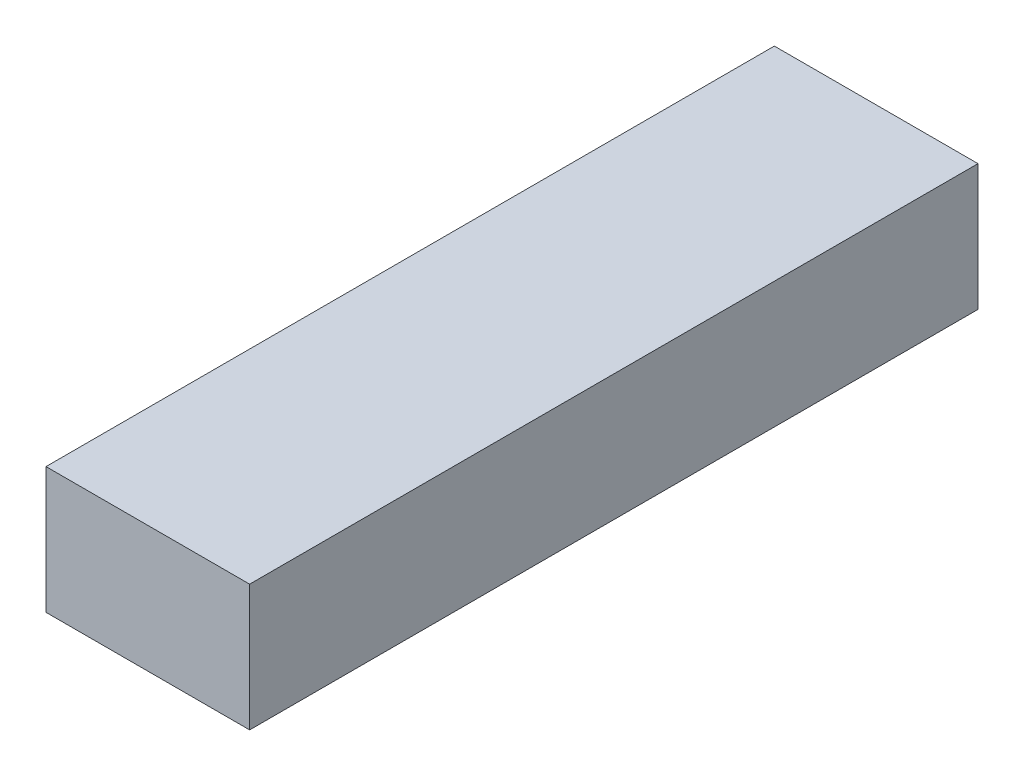
ISO-10303-21;
HEADER;
FILE_DESCRIPTION(('STEP AP214'),'2;1');
FILE_NAME('part.step','',(''),(''),'','','');
FILE_SCHEMA(('AUTOMOTIVE_DESIGN { 1 0 10303 214 1 1 1 1 }'));
ENDSEC;
DATA;
#1=APPLICATION_CONTEXT('core data for automotive mechanical design processes');
#2=APPLICATION_PROTOCOL_DEFINITION('international standard','automotive_design',2000,#1);
#3=PRODUCT_CONTEXT('',#1,'mechanical');
#4=PRODUCT('Part','Part','',(#3));
#5=PRODUCT_RELATED_PRODUCT_CATEGORY('part','',(#4));
#6=PRODUCT_DEFINITION_FORMATION('','',#4);
#7=PRODUCT_DEFINITION_CONTEXT('part definition',#1,'design');
#8=PRODUCT_DEFINITION('design','',#6,#7);
#9=PRODUCT_DEFINITION_SHAPE('','',#8);
#10=(LENGTH_UNIT() NAMED_UNIT(*) SI_UNIT(.MILLI.,.METRE.));
#11=(NAMED_UNIT(*) PLANE_ANGLE_UNIT() SI_UNIT($,.RADIAN.));
#12=(NAMED_UNIT(*) SI_UNIT($,.STERADIAN.) SOLID_ANGLE_UNIT());
#13=UNCERTAINTY_MEASURE_WITH_UNIT(LENGTH_MEASURE(1.E-05),#10,'distance_accuracy_value','');
#14=(GEOMETRIC_REPRESENTATION_CONTEXT(3) GLOBAL_UNCERTAINTY_ASSIGNED_CONTEXT((#13)) GLOBAL_UNIT_ASSIGNED_CONTEXT((#10,
#11,#12)) REPRESENTATION_CONTEXT('',''));
#15=CARTESIAN_POINT('',(0.,0.,0.));
#16=DIRECTION('',(0.,0.,1.));
#17=DIRECTION('',(1.,0.,0.));
#18=AXIS2_PLACEMENT_3D('',#15,#16,#17);
#19=CARTESIAN_POINT('',(-105.11421572935,33.8480011912268,-75.800025));
#20=DIRECTION('',(1.,0.,0.));
#21=DIRECTION('',(0.,0.,-1.));
#22=AXIS2_PLACEMENT_3D('',#19,#20,#21);
#23=PLANE('',#22);
#24=DIRECTION('',(0.,1.,0.));
#25=VECTOR('',#24,1.);
#26=CARTESIAN_POINT('',(-105.11421572935,33.8480011912268,44.199975));
#27=LINE('',#26,#25);
#28=CARTESIAN_POINT('',(-105.11421572935,33.8480011912268,44.199975));
#29=VERTEX_POINT('',#28);
#30=CARTESIAN_POINT('',(-105.11421572935,54.6480011912268,44.199975));
#31=VERTEX_POINT('',#30);
#32=EDGE_CURVE('E95',#29,#31,#27,.T.);
#33=ORIENTED_EDGE('',*,*,#32,.T.);
#34=DIRECTION('',(0.,0.,1.));
#35=VECTOR('',#34,1.);
#36=CARTESIAN_POINT('',(-105.11421572935,54.6480011912268,-75.800025));
#37=LINE('',#36,#35);
#38=CARTESIAN_POINT('',(-105.11421572935,54.6480011912268,-75.800025));
#39=VERTEX_POINT('',#38);
#40=EDGE_CURVE('E11',#39,#31,#37,.T.);
#41=ORIENTED_EDGE('',*,*,#40,.F.);
#42=DIRECTION('',(0.,1.,0.));
#43=VECTOR('',#42,1.);
#44=CARTESIAN_POINT('',(-105.11421572935,33.8480011912268,-75.800025));
#45=LINE('',#44,#43);
#46=CARTESIAN_POINT('',(-105.11421572935,33.8480011912268,-75.800025));
#47=VERTEX_POINT('',#46);
#48=EDGE_CURVE('E83',#47,#39,#45,.T.);
#49=ORIENTED_EDGE('',*,*,#48,.F.);
#50=DIRECTION('',(0.,0.,1.));
#51=VECTOR('',#50,1.);
#52=CARTESIAN_POINT('',(-105.11421572935,33.8480011912268,-75.800025));
#53=LINE('',#52,#51);
#54=EDGE_CURVE('E91',#47,#29,#53,.T.);
#55=ORIENTED_EDGE('',*,*,#54,.T.);
#56=EDGE_LOOP('',(#33,#41,#49,#55));
#57=FACE_BOUND('',#56,.T.);
#58=ADVANCED_FACE('F32',(#57),#23,.F.);
#59=CARTESIAN_POINT('',(-105.11421572935,54.6480011912268,-75.800025));
#60=DIRECTION('',(0.,-1.,0.));
#61=DIRECTION('',(0.,0.,-1.));
#62=AXIS2_PLACEMENT_3D('',#59,#60,#61);
#63=PLANE('',#62);
#64=DIRECTION('',(1.,0.,0.));
#65=VECTOR('',#64,1.);
#66=CARTESIAN_POINT('',(-105.11421572935,54.6480011912268,44.199975));
#67=LINE('',#66,#65);
#68=CARTESIAN_POINT('',(-71.5642157293498,54.6480011912268,44.199975));
#69=VERTEX_POINT('',#68);
#70=EDGE_CURVE('E87',#31,#69,#67,.T.);
#71=ORIENTED_EDGE('',*,*,#70,.T.);
#72=DIRECTION('',(0.,0.,1.));
#73=VECTOR('',#72,1.);
#74=CARTESIAN_POINT('',(-71.5642157293498,54.6480011912268,-75.800025));
#75=LINE('',#74,#73);
#76=CARTESIAN_POINT('',(-71.5642157293498,54.6480011912268,-75.800025));
#77=VERTEX_POINT('',#76);
#78=EDGE_CURVE('E40',#77,#69,#75,.T.);
#79=ORIENTED_EDGE('',*,*,#78,.F.);
#80=DIRECTION('',(1.,0.,0.));
#81=VECTOR('',#80,1.);
#82=CARTESIAN_POINT('',(-105.11421572935,54.6480011912268,-75.800025));
#83=LINE('',#82,#81);
#84=EDGE_CURVE('E78',#39,#77,#83,.T.);
#85=ORIENTED_EDGE('',*,*,#84,.F.);
#86=ORIENTED_EDGE('',*,*,#40,.T.);
#87=EDGE_LOOP('',(#71,#79,#85,#86));
#88=FACE_BOUND('',#87,.T.);
#89=ADVANCED_FACE('F86',(#88),#63,.F.);
#90=CARTESIAN_POINT('',(-71.5642157293498,33.8480011912268,-75.800025));
#91=DIRECTION('',(-1.,0.,0.));
#92=DIRECTION('',(0.,0.,1.));
#93=AXIS2_PLACEMENT_3D('',#90,#91,#92);
#94=PLANE('',#93);
#95=DIRECTION('',(0.,-1.,0.));
#96=VECTOR('',#95,1.);
#97=CARTESIAN_POINT('',(-71.5642157293498,33.8480011912268,44.199975));
#98=LINE('',#97,#96);
#99=CARTESIAN_POINT('',(-71.5642157293498,33.8480011912268,44.199975));
#100=VERTEX_POINT('',#99);
#101=EDGE_CURVE('E65',#69,#100,#98,.T.);
#102=ORIENTED_EDGE('',*,*,#101,.T.);
#103=DIRECTION('',(0.,0.,1.));
#104=VECTOR('',#103,1.);
#105=CARTESIAN_POINT('',(-71.5642157293498,33.8480011912268,-75.800025));
#106=LINE('',#105,#104);
#107=CARTESIAN_POINT('',(-71.5642157293498,33.8480011912268,-75.800025));
#108=VERTEX_POINT('',#107);
#109=EDGE_CURVE('E88',#108,#100,#106,.T.);
#110=ORIENTED_EDGE('',*,*,#109,.F.);
#111=DIRECTION('',(0.,-1.,0.));
#112=VECTOR('',#111,1.);
#113=CARTESIAN_POINT('',(-71.5642157293498,33.8480011912268,-75.800025));
#114=LINE('',#113,#112);
#115=EDGE_CURVE('E81',#77,#108,#114,.T.);
#116=ORIENTED_EDGE('',*,*,#115,.F.);
#117=ORIENTED_EDGE('',*,*,#78,.T.);
#118=EDGE_LOOP('',(#102,#110,#116,#117));
#119=FACE_BOUND('',#118,.T.);
#120=ADVANCED_FACE('F89',(#119),#94,.F.);
#121=CARTESIAN_POINT('',(-105.11421572935,33.8480011912268,-75.800025));
#122=DIRECTION('',(0.,1.,0.));
#123=DIRECTION('',(-1.,0.,0.));
#124=AXIS2_PLACEMENT_3D('',#121,#122,#123);
#125=PLANE('',#124);
#126=DIRECTION('',(-1.,0.,0.));
#127=VECTOR('',#126,1.);
#128=CARTESIAN_POINT('',(-105.11421572935,33.8480011912268,44.199975));
#129=LINE('',#128,#127);
#130=EDGE_CURVE('E71',#100,#29,#129,.T.);
#131=ORIENTED_EDGE('',*,*,#130,.T.);
#132=ORIENTED_EDGE('',*,*,#54,.F.);
#133=DIRECTION('',(-1.,0.,0.));
#134=VECTOR('',#133,1.);
#135=CARTESIAN_POINT('',(-105.11421572935,33.8480011912268,-75.800025));
#136=LINE('',#135,#134);
#137=EDGE_CURVE('E48',#108,#47,#136,.T.);
#138=ORIENTED_EDGE('',*,*,#137,.F.);
#139=ORIENTED_EDGE('',*,*,#109,.T.);
#140=EDGE_LOOP('',(#131,#132,#138,#139));
#141=FACE_BOUND('',#140,.T.);
#142=ADVANCED_FACE('F102',(#141),#125,.F.);
#143=CARTESIAN_POINT('',(0.,0.,-75.800025));
#144=DIRECTION('',(0.,0.,-1.));
#145=DIRECTION('',(-1.,0.,0.));
#146=AXIS2_PLACEMENT_3D('',#143,#144,#145);
#147=PLANE('',#146);
#148=ORIENTED_EDGE('',*,*,#48,.T.);
#149=ORIENTED_EDGE('',*,*,#84,.T.);
#150=ORIENTED_EDGE('',*,*,#115,.T.);
#151=ORIENTED_EDGE('',*,*,#137,.T.);
#152=EDGE_LOOP('',(#148,#149,#150,#151));
#153=FACE_BOUND('',#152,.T.);
#154=ADVANCED_FACE('F79',(#153),#147,.T.);
#155=CARTESIAN_POINT('',(0.,0.,44.199975));
#156=DIRECTION('',(0.,0.,-1.));
#157=DIRECTION('',(-1.,0.,0.));
#158=AXIS2_PLACEMENT_3D('',#155,#156,#157);
#159=PLANE('',#158);
#160=ORIENTED_EDGE('',*,*,#32,.F.);
#161=ORIENTED_EDGE('',*,*,#130,.F.);
#162=ORIENTED_EDGE('',*,*,#101,.F.);
#163=ORIENTED_EDGE('',*,*,#70,.F.);
#164=EDGE_LOOP('',(#160,#161,#162,#163));
#165=FACE_BOUND('',#164,.T.);
#166=ADVANCED_FACE('F105',(#165),#159,.F.);
#167=CLOSED_SHELL('',(#58,#89,#120,#142,#154,#166));
#168=MANIFOLD_SOLID_BREP('B2',#167);
#169=ADVANCED_BREP_SHAPE_REPRESENTATION('',(#18,#168),#14);
#170=SHAPE_DEFINITION_REPRESENTATION(#9,#169);
ENDSEC;
END-ISO-10303-21;
